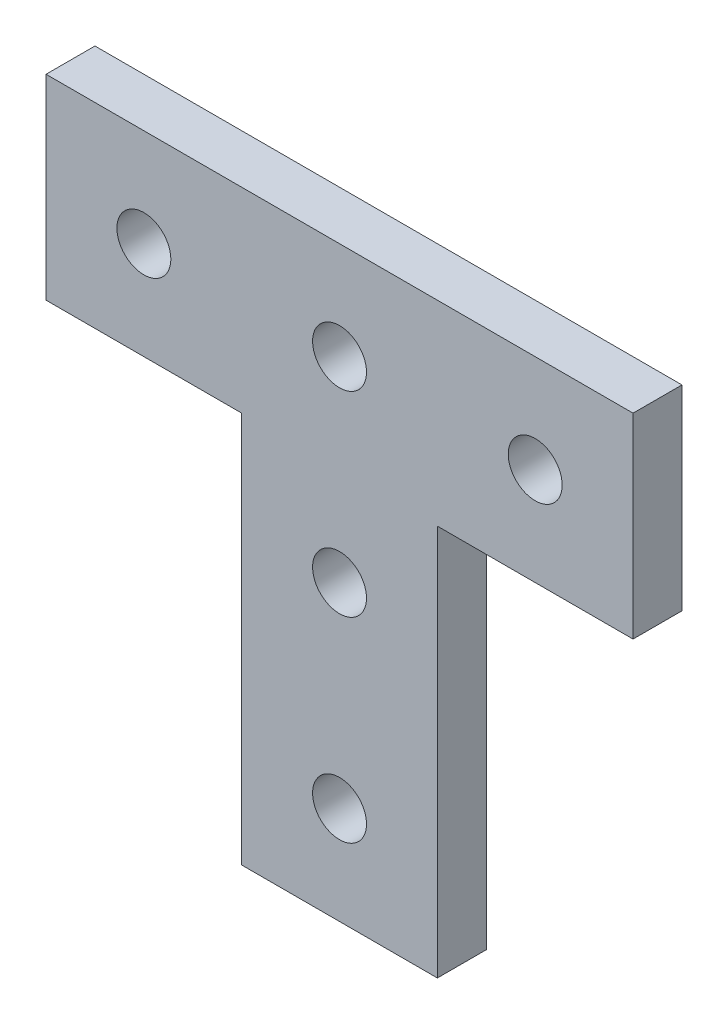
ISO-10303-21;
HEADER;
FILE_DESCRIPTION(('STEP AP214'),'2;1');
FILE_NAME('part.step','',(''),(''),'','','');
FILE_SCHEMA(('AUTOMOTIVE_DESIGN { 1 0 10303 214 1 1 1 1 }'));
ENDSEC;
DATA;
#1=APPLICATION_CONTEXT('core data for automotive mechanical design processes');
#2=APPLICATION_PROTOCOL_DEFINITION('international standard','automotive_design',2000,#1);
#3=PRODUCT_CONTEXT('',#1,'mechanical');
#4=PRODUCT('Part','Part','',(#3));
#5=PRODUCT_RELATED_PRODUCT_CATEGORY('part','',(#4));
#6=PRODUCT_DEFINITION_FORMATION('','',#4);
#7=PRODUCT_DEFINITION_CONTEXT('part definition',#1,'design');
#8=PRODUCT_DEFINITION('design','',#6,#7);
#9=PRODUCT_DEFINITION_SHAPE('','',#8);
#10=(LENGTH_UNIT() NAMED_UNIT(*) SI_UNIT(.MILLI.,.METRE.));
#11=(NAMED_UNIT(*) PLANE_ANGLE_UNIT() SI_UNIT($,.RADIAN.));
#12=(NAMED_UNIT(*) SI_UNIT($,.STERADIAN.) SOLID_ANGLE_UNIT());
#13=UNCERTAINTY_MEASURE_WITH_UNIT(LENGTH_MEASURE(1.E-05),#10,'distance_accuracy_value','');
#14=(GEOMETRIC_REPRESENTATION_CONTEXT(3) GLOBAL_UNCERTAINTY_ASSIGNED_CONTEXT((#13)) GLOBAL_UNIT_ASSIGNED_CONTEXT((#10,
#11,#12)) REPRESENTATION_CONTEXT('',''));
#15=CARTESIAN_POINT('',(0.,0.,0.));
#16=DIRECTION('',(0.,0.,1.));
#17=DIRECTION('',(1.,0.,0.));
#18=AXIS2_PLACEMENT_3D('',#15,#16,#17);
#19=CARTESIAN_POINT('',(12.7,50.8,6.35));
#20=DIRECTION('',(-1.,0.,0.));
#21=DIRECTION('',(0.,-1.,0.));
#22=AXIS2_PLACEMENT_3D('',#19,#20,#21);
#23=PLANE('',#22);
#24=DIRECTION('',(0.,1.,0.));
#25=VECTOR('',#24,1.);
#26=CARTESIAN_POINT('',(12.7,50.8,0.));
#27=LINE('',#26,#25);
#28=CARTESIAN_POINT('',(12.7,0.,0.));
#29=VERTEX_POINT('',#28);
#30=CARTESIAN_POINT('',(12.7,50.8,0.));
#31=VERTEX_POINT('',#30);
#32=EDGE_CURVE('E132',#29,#31,#27,.T.);
#33=ORIENTED_EDGE('',*,*,#32,.T.);
#34=DIRECTION('',(0.,0.,-1.));
#35=VECTOR('',#34,1.);
#36=CARTESIAN_POINT('',(12.7,50.8,6.35));
#37=LINE('',#36,#35);
#38=CARTESIAN_POINT('',(12.7,50.8,6.35));
#39=VERTEX_POINT('',#38);
#40=EDGE_CURVE('E11',#39,#31,#37,.T.);
#41=ORIENTED_EDGE('',*,*,#40,.F.);
#42=DIRECTION('',(0.,1.,0.));
#43=VECTOR('',#42,1.);
#44=CARTESIAN_POINT('',(12.7,50.8,6.35));
#45=LINE('',#44,#43);
#46=CARTESIAN_POINT('',(12.7,0.,6.35));
#47=VERTEX_POINT('',#46);
#48=EDGE_CURVE('E147',#47,#39,#45,.T.);
#49=ORIENTED_EDGE('',*,*,#48,.F.);
#50=DIRECTION('',(0.,0.,-1.));
#51=VECTOR('',#50,1.);
#52=CARTESIAN_POINT('',(12.7,0.,6.35));
#53=LINE('',#52,#51);
#54=EDGE_CURVE('E128',#47,#29,#53,.T.);
#55=ORIENTED_EDGE('',*,*,#54,.T.);
#56=EDGE_LOOP('',(#33,#41,#49,#55));
#57=FACE_BOUND('',#56,.T.);
#58=ADVANCED_FACE('F36',(#57),#23,.F.);
#59=CARTESIAN_POINT('',(38.1,50.8,6.35));
#60=DIRECTION('',(0.,1.,0.));
#61=DIRECTION('',(-1.,0.,0.));
#62=AXIS2_PLACEMENT_3D('',#59,#60,#61);
#63=PLANE('',#62);
#64=DIRECTION('',(1.,0.,0.));
#65=VECTOR('',#64,1.);
#66=CARTESIAN_POINT('',(38.1,50.8,0.));
#67=LINE('',#66,#65);
#68=CARTESIAN_POINT('',(38.1,50.8,0.));
#69=VERTEX_POINT('',#68);
#70=EDGE_CURVE('E135',#31,#69,#67,.T.);
#71=ORIENTED_EDGE('',*,*,#70,.T.);
#72=DIRECTION('',(0.,0.,-1.));
#73=VECTOR('',#72,1.);
#74=CARTESIAN_POINT('',(38.1,50.8,6.35));
#75=LINE('',#74,#73);
#76=CARTESIAN_POINT('',(38.1,50.8,6.35));
#77=VERTEX_POINT('',#76);
#78=EDGE_CURVE('E44',#77,#69,#75,.T.);
#79=ORIENTED_EDGE('',*,*,#78,.F.);
#80=DIRECTION('',(1.,0.,0.));
#81=VECTOR('',#80,1.);
#82=CARTESIAN_POINT('',(38.1,50.8,6.35));
#83=LINE('',#82,#81);
#84=EDGE_CURVE('E95',#39,#77,#83,.T.);
#85=ORIENTED_EDGE('',*,*,#84,.F.);
#86=ORIENTED_EDGE('',*,*,#40,.T.);
#87=EDGE_LOOP('',(#71,#79,#85,#86));
#88=FACE_BOUND('',#87,.T.);
#89=ADVANCED_FACE('F238',(#88),#63,.F.);
#90=CARTESIAN_POINT('',(38.1,76.2,6.35));
#91=DIRECTION('',(-1.,0.,0.));
#92=DIRECTION('',(0.,0.,1.));
#93=AXIS2_PLACEMENT_3D('',#90,#91,#92);
#94=PLANE('',#93);
#95=DIRECTION('',(0.,1.,0.));
#96=VECTOR('',#95,1.);
#97=CARTESIAN_POINT('',(38.1,76.2,0.));
#98=LINE('',#97,#96);
#99=CARTESIAN_POINT('',(38.1,76.2,0.));
#100=VERTEX_POINT('',#99);
#101=EDGE_CURVE('E138',#69,#100,#98,.T.);
#102=ORIENTED_EDGE('',*,*,#101,.T.);
#103=DIRECTION('',(0.,0.,-1.));
#104=VECTOR('',#103,1.);
#105=CARTESIAN_POINT('',(38.1,76.2,6.35));
#106=LINE('',#105,#104);
#107=CARTESIAN_POINT('',(38.1,76.2,6.35));
#108=VERTEX_POINT('',#107);
#109=EDGE_CURVE('E154',#108,#100,#106,.T.);
#110=ORIENTED_EDGE('',*,*,#109,.F.);
#111=DIRECTION('',(0.,1.,0.));
#112=VECTOR('',#111,1.);
#113=CARTESIAN_POINT('',(38.1,76.2,6.35));
#114=LINE('',#113,#112);
#115=EDGE_CURVE('E162',#77,#108,#114,.T.);
#116=ORIENTED_EDGE('',*,*,#115,.F.);
#117=ORIENTED_EDGE('',*,*,#78,.T.);
#118=EDGE_LOOP('',(#102,#110,#116,#117));
#119=FACE_BOUND('',#118,.T.);
#120=ADVANCED_FACE('F160',(#119),#94,.F.);
#121=CARTESIAN_POINT('',(-38.1,76.2,6.35));
#122=DIRECTION('',(0.,-1.,0.));
#123=DIRECTION('',(0.,0.,-1.));
#124=AXIS2_PLACEMENT_3D('',#121,#122,#123);
#125=PLANE('',#124);
#126=DIRECTION('',(-1.,0.,0.));
#127=VECTOR('',#126,1.);
#128=CARTESIAN_POINT('',(-38.1,76.2,0.));
#129=LINE('',#128,#127);
#130=CARTESIAN_POINT('',(-38.1,76.2,0.));
#131=VERTEX_POINT('',#130);
#132=EDGE_CURVE('E140',#100,#131,#129,.T.);
#133=ORIENTED_EDGE('',*,*,#132,.T.);
#134=DIRECTION('',(0.,0.,-1.));
#135=VECTOR('',#134,1.);
#136=CARTESIAN_POINT('',(-38.1,76.2,6.35));
#137=LINE('',#136,#135);
#138=CARTESIAN_POINT('',(-38.1,76.2,6.35));
#139=VERTEX_POINT('',#138);
#140=EDGE_CURVE('E151',#139,#131,#137,.T.);
#141=ORIENTED_EDGE('',*,*,#140,.F.);
#142=DIRECTION('',(-1.,0.,0.));
#143=VECTOR('',#142,1.);
#144=CARTESIAN_POINT('',(-38.1,76.2,6.35));
#145=LINE('',#144,#143);
#146=EDGE_CURVE('E174',#108,#139,#145,.T.);
#147=ORIENTED_EDGE('',*,*,#146,.F.);
#148=ORIENTED_EDGE('',*,*,#109,.T.);
#149=EDGE_LOOP('',(#133,#141,#147,#148));
#150=FACE_BOUND('',#149,.T.);
#151=ADVANCED_FACE('F170',(#150),#125,.F.);
#152=CARTESIAN_POINT('',(-38.1,50.8,6.35));
#153=DIRECTION('',(1.,0.,0.));
#154=DIRECTION('',(0.,0.,-1.));
#155=AXIS2_PLACEMENT_3D('',#152,#153,#154);
#156=PLANE('',#155);
#157=DIRECTION('',(0.,-1.,0.));
#158=VECTOR('',#157,1.);
#159=CARTESIAN_POINT('',(-38.1,50.8,0.));
#160=LINE('',#159,#158);
#161=CARTESIAN_POINT('',(-38.1,50.8,0.));
#162=VERTEX_POINT('',#161);
#163=EDGE_CURVE('E142',#131,#162,#160,.T.);
#164=ORIENTED_EDGE('',*,*,#163,.T.);
#165=DIRECTION('',(0.,0.,-1.));
#166=VECTOR('',#165,1.);
#167=CARTESIAN_POINT('',(-38.1,50.8,6.35));
#168=LINE('',#167,#166);
#169=CARTESIAN_POINT('',(-38.1,50.8,6.35));
#170=VERTEX_POINT('',#169);
#171=EDGE_CURVE('E123',#170,#162,#168,.T.);
#172=ORIENTED_EDGE('',*,*,#171,.F.);
#173=DIRECTION('',(0.,-1.,0.));
#174=VECTOR('',#173,1.);
#175=CARTESIAN_POINT('',(-38.1,50.8,6.35));
#176=LINE('',#175,#174);
#177=EDGE_CURVE('E114',#139,#170,#176,.T.);
#178=ORIENTED_EDGE('',*,*,#177,.F.);
#179=ORIENTED_EDGE('',*,*,#140,.T.);
#180=EDGE_LOOP('',(#164,#172,#178,#179));
#181=FACE_BOUND('',#180,.T.);
#182=ADVANCED_FACE('F173',(#181),#156,.F.);
#183=CARTESIAN_POINT('',(-12.7,50.8,6.35));
#184=DIRECTION('',(0.,1.,0.));
#185=DIRECTION('',(0.,0.,1.));
#186=AXIS2_PLACEMENT_3D('',#183,#184,#185);
#187=PLANE('',#186);
#188=DIRECTION('',(1.,0.,0.));
#189=VECTOR('',#188,1.);
#190=CARTESIAN_POINT('',(-12.7,50.8,0.));
#191=LINE('',#190,#189);
#192=CARTESIAN_POINT('',(-12.7,50.8,0.));
#193=VERTEX_POINT('',#192);
#194=EDGE_CURVE('E122',#162,#193,#191,.T.);
#195=ORIENTED_EDGE('',*,*,#194,.T.);
#196=DIRECTION('',(0.,0.,-1.));
#197=VECTOR('',#196,1.);
#198=CARTESIAN_POINT('',(-12.7,50.8,6.35));
#199=LINE('',#198,#197);
#200=CARTESIAN_POINT('',(-12.7,50.8,6.35));
#201=VERTEX_POINT('',#200);
#202=EDGE_CURVE('E119',#201,#193,#199,.T.);
#203=ORIENTED_EDGE('',*,*,#202,.F.);
#204=DIRECTION('',(1.,0.,0.));
#205=VECTOR('',#204,1.);
#206=CARTESIAN_POINT('',(-12.7,50.8,6.35));
#207=LINE('',#206,#205);
#208=EDGE_CURVE('E108',#170,#201,#207,.T.);
#209=ORIENTED_EDGE('',*,*,#208,.F.);
#210=ORIENTED_EDGE('',*,*,#171,.T.);
#211=EDGE_LOOP('',(#195,#203,#209,#210));
#212=FACE_BOUND('',#211,.T.);
#213=ADVANCED_FACE('F120',(#212),#187,.F.);
#214=CARTESIAN_POINT('',(-12.7,0.,6.35));
#215=DIRECTION('',(1.,0.,0.));
#216=DIRECTION('',(0.,0.,-1.));
#217=AXIS2_PLACEMENT_3D('',#214,#215,#216);
#218=PLANE('',#217);
#219=DIRECTION('',(0.,-1.,0.));
#220=VECTOR('',#219,1.);
#221=CARTESIAN_POINT('',(-12.7,0.,0.));
#222=LINE('',#221,#220);
#223=CARTESIAN_POINT('',(-12.7,0.,0.));
#224=VERTEX_POINT('',#223);
#225=EDGE_CURVE('E81',#193,#224,#222,.T.);
#226=ORIENTED_EDGE('',*,*,#225,.T.);
#227=DIRECTION('',(0.,0.,-1.));
#228=VECTOR('',#227,1.);
#229=CARTESIAN_POINT('',(-12.7,0.,6.35));
#230=LINE('',#229,#228);
#231=CARTESIAN_POINT('',(-12.7,0.,6.35));
#232=VERTEX_POINT('',#231);
#233=EDGE_CURVE('E124',#232,#224,#230,.T.);
#234=ORIENTED_EDGE('',*,*,#233,.F.);
#235=DIRECTION('',(0.,-1.,0.));
#236=VECTOR('',#235,1.);
#237=CARTESIAN_POINT('',(-12.7,0.,6.35));
#238=LINE('',#237,#236);
#239=EDGE_CURVE('E112',#201,#232,#238,.T.);
#240=ORIENTED_EDGE('',*,*,#239,.F.);
#241=ORIENTED_EDGE('',*,*,#202,.T.);
#242=EDGE_LOOP('',(#226,#234,#240,#241));
#243=FACE_BOUND('',#242,.T.);
#244=ADVANCED_FACE('F126',(#243),#218,.F.);
#245=CARTESIAN_POINT('',(12.7,0.,6.35));
#246=DIRECTION('',(0.,1.,0.));
#247=DIRECTION('',(-1.,0.,0.));
#248=AXIS2_PLACEMENT_3D('',#245,#246,#247);
#249=PLANE('',#248);
#250=DIRECTION('',(1.,0.,0.));
#251=VECTOR('',#250,1.);
#252=CARTESIAN_POINT('',(12.7,0.,0.));
#253=LINE('',#252,#251);
#254=EDGE_CURVE('E87',#224,#29,#253,.T.);
#255=ORIENTED_EDGE('',*,*,#254,.T.);
#256=ORIENTED_EDGE('',*,*,#54,.F.);
#257=DIRECTION('',(1.,0.,0.));
#258=VECTOR('',#257,1.);
#259=CARTESIAN_POINT('',(12.7,0.,6.35));
#260=LINE('',#259,#258);
#261=EDGE_CURVE('E52',#232,#47,#260,.T.);
#262=ORIENTED_EDGE('',*,*,#261,.F.);
#263=ORIENTED_EDGE('',*,*,#233,.T.);
#264=EDGE_LOOP('',(#255,#256,#262,#263));
#265=FACE_BOUND('',#264,.T.);
#266=ADVANCED_FACE('F222',(#265),#249,.F.);
#267=CARTESIAN_POINT('',(0.,0.,6.35));
#268=DIRECTION('',(0.,0.,-1.));
#269=DIRECTION('',(-1.,0.,0.));
#270=AXIS2_PLACEMENT_3D('',#267,#268,#269);
#271=PLANE('',#270);
#272=CARTESIAN_POINT('',(0.,12.7,6.35));
#273=DIRECTION('',(0.,0.,1.));
#274=DIRECTION('',(1.,0.,0.));
#275=AXIS2_PLACEMENT_3D('',#272,#273,#274);
#276=CIRCLE('',#275,3.5);
#277=CARTESIAN_POINT('',(3.5,12.7,6.35));
#278=VERTEX_POINT('',#277);
#279=EDGE_CURVE('E186',#278,#278,#276,.T.);
#280=ORIENTED_EDGE('',*,*,#279,.F.);
#281=EDGE_LOOP('',(#280));
#282=FACE_BOUND('',#281,.T.);
#283=CARTESIAN_POINT('',(0.,38.1,6.35));
#284=DIRECTION('',(0.,0.,1.));
#285=DIRECTION('',(1.,0.,0.));
#286=AXIS2_PLACEMENT_3D('',#283,#284,#285);
#287=CIRCLE('',#286,3.5);
#288=CARTESIAN_POINT('',(3.5,38.1,6.35));
#289=VERTEX_POINT('',#288);
#290=EDGE_CURVE('E192',#289,#289,#287,.T.);
#291=ORIENTED_EDGE('',*,*,#290,.F.);
#292=EDGE_LOOP('',(#291));
#293=FACE_BOUND('',#292,.T.);
#294=CARTESIAN_POINT('',(-25.4,63.5,6.35));
#295=DIRECTION('',(0.,0.,1.));
#296=DIRECTION('',(1.,0.,0.));
#297=AXIS2_PLACEMENT_3D('',#294,#295,#296);
#298=CIRCLE('',#297,3.5);
#299=CARTESIAN_POINT('',(-21.9,63.5,6.35));
#300=VERTEX_POINT('',#299);
#301=EDGE_CURVE('E198',#300,#300,#298,.T.);
#302=ORIENTED_EDGE('',*,*,#301,.F.);
#303=EDGE_LOOP('',(#302));
#304=FACE_BOUND('',#303,.T.);
#305=CARTESIAN_POINT('',(25.4,63.5,6.35));
#306=DIRECTION('',(0.,0.,1.));
#307=DIRECTION('',(1.,0.,0.));
#308=AXIS2_PLACEMENT_3D('',#305,#306,#307);
#309=CIRCLE('',#308,3.5);
#310=CARTESIAN_POINT('',(28.9,63.5,6.35));
#311=VERTEX_POINT('',#310);
#312=EDGE_CURVE('E204',#311,#311,#309,.T.);
#313=ORIENTED_EDGE('',*,*,#312,.F.);
#314=EDGE_LOOP('',(#313));
#315=FACE_BOUND('',#314,.T.);
#316=CARTESIAN_POINT('',(0.,63.5,6.35));
#317=DIRECTION('',(0.,0.,1.));
#318=DIRECTION('',(1.,0.,0.));
#319=AXIS2_PLACEMENT_3D('',#316,#317,#318);
#320=CIRCLE('',#319,3.5);
#321=CARTESIAN_POINT('',(3.5,63.5,6.35));
#322=VERTEX_POINT('',#321);
#323=EDGE_CURVE('E180',#322,#322,#320,.T.);
#324=ORIENTED_EDGE('',*,*,#323,.F.);
#325=EDGE_LOOP('',(#324));
#326=FACE_BOUND('',#325,.T.);
#327=ORIENTED_EDGE('',*,*,#48,.T.);
#328=ORIENTED_EDGE('',*,*,#84,.T.);
#329=ORIENTED_EDGE('',*,*,#115,.T.);
#330=ORIENTED_EDGE('',*,*,#146,.T.);
#331=ORIENTED_EDGE('',*,*,#177,.T.);
#332=ORIENTED_EDGE('',*,*,#208,.T.);
#333=ORIENTED_EDGE('',*,*,#239,.T.);
#334=ORIENTED_EDGE('',*,*,#261,.T.);
#335=EDGE_LOOP('',(#327,#328,#329,#330,#331,#332,#333,#334));
#336=FACE_BOUND('',#335,.T.);
#337=ADVANCED_FACE('F110',(#282,#293,#304,#315,#326,#336),#271,.F.);
#338=CARTESIAN_POINT('',(0.,0.,0.));
#339=DIRECTION('',(0.,0.,-1.));
#340=DIRECTION('',(-1.,0.,0.));
#341=AXIS2_PLACEMENT_3D('',#338,#339,#340);
#342=PLANE('',#341);
#343=CARTESIAN_POINT('',(0.,12.7,0.));
#344=DIRECTION('',(0.,0.,1.));
#345=DIRECTION('',(1.,0.,0.));
#346=AXIS2_PLACEMENT_3D('',#343,#344,#345);
#347=CIRCLE('',#346,3.5);
#348=CARTESIAN_POINT('',(3.5,12.7,0.));
#349=VERTEX_POINT('',#348);
#350=EDGE_CURVE('E189',#349,#349,#347,.T.);
#351=ORIENTED_EDGE('',*,*,#350,.T.);
#352=EDGE_LOOP('',(#351));
#353=FACE_BOUND('',#352,.T.);
#354=CARTESIAN_POINT('',(0.,38.1,0.));
#355=DIRECTION('',(0.,0.,1.));
#356=DIRECTION('',(1.,0.,0.));
#357=AXIS2_PLACEMENT_3D('',#354,#355,#356);
#358=CIRCLE('',#357,3.5);
#359=CARTESIAN_POINT('',(3.5,38.1,0.));
#360=VERTEX_POINT('',#359);
#361=EDGE_CURVE('E195',#360,#360,#358,.T.);
#362=ORIENTED_EDGE('',*,*,#361,.T.);
#363=EDGE_LOOP('',(#362));
#364=FACE_BOUND('',#363,.T.);
#365=CARTESIAN_POINT('',(-25.4,63.5,0.));
#366=DIRECTION('',(0.,0.,1.));
#367=DIRECTION('',(1.,0.,0.));
#368=AXIS2_PLACEMENT_3D('',#365,#366,#367);
#369=CIRCLE('',#368,3.5);
#370=CARTESIAN_POINT('',(-21.9,63.5,0.));
#371=VERTEX_POINT('',#370);
#372=EDGE_CURVE('E201',#371,#371,#369,.T.);
#373=ORIENTED_EDGE('',*,*,#372,.T.);
#374=EDGE_LOOP('',(#373));
#375=FACE_BOUND('',#374,.T.);
#376=CARTESIAN_POINT('',(25.4,63.5,0.));
#377=DIRECTION('',(0.,0.,1.));
#378=DIRECTION('',(1.,0.,0.));
#379=AXIS2_PLACEMENT_3D('',#376,#377,#378);
#380=CIRCLE('',#379,3.5);
#381=CARTESIAN_POINT('',(28.9,63.5,0.));
#382=VERTEX_POINT('',#381);
#383=EDGE_CURVE('E183',#382,#382,#380,.T.);
#384=ORIENTED_EDGE('',*,*,#383,.T.);
#385=EDGE_LOOP('',(#384));
#386=FACE_BOUND('',#385,.T.);
#387=CARTESIAN_POINT('',(0.,63.5,0.));
#388=DIRECTION('',(0.,0.,1.));
#389=DIRECTION('',(1.,0.,0.));
#390=AXIS2_PLACEMENT_3D('',#387,#388,#389);
#391=CIRCLE('',#390,3.5);
#392=CARTESIAN_POINT('',(3.5,63.5,0.));
#393=VERTEX_POINT('',#392);
#394=EDGE_CURVE('E136',#393,#393,#391,.T.);
#395=ORIENTED_EDGE('',*,*,#394,.T.);
#396=EDGE_LOOP('',(#395));
#397=FACE_BOUND('',#396,.T.);
#398=ORIENTED_EDGE('',*,*,#32,.F.);
#399=ORIENTED_EDGE('',*,*,#254,.F.);
#400=ORIENTED_EDGE('',*,*,#225,.F.);
#401=ORIENTED_EDGE('',*,*,#194,.F.);
#402=ORIENTED_EDGE('',*,*,#163,.F.);
#403=ORIENTED_EDGE('',*,*,#132,.F.);
#404=ORIENTED_EDGE('',*,*,#101,.F.);
#405=ORIENTED_EDGE('',*,*,#70,.F.);
#406=EDGE_LOOP('',(#398,#399,#400,#401,#402,#403,#404,#405));
#407=FACE_BOUND('',#406,.T.);
#408=ADVANCED_FACE('F166',(#353,#364,#375,#386,#397,#407),#342,.T.);
#409=CARTESIAN_POINT('',(0.,63.5,0.));
#410=DIRECTION('',(0.,0.,1.));
#411=DIRECTION('',(1.,0.,0.));
#412=AXIS2_PLACEMENT_3D('',#409,#410,#411);
#413=CYLINDRICAL_SURFACE('',#412,3.5);
#414=ORIENTED_EDGE('',*,*,#394,.F.);
#415=EDGE_LOOP('',(#414));
#416=FACE_BOUND('',#415,.T.);
#417=ORIENTED_EDGE('',*,*,#323,.T.);
#418=EDGE_LOOP('',(#417));
#419=FACE_BOUND('',#418,.T.);
#420=ADVANCED_FACE('F216',(#416,#419),#413,.F.);
#421=CARTESIAN_POINT('',(25.4,63.5,0.));
#422=DIRECTION('',(0.,0.,1.));
#423=DIRECTION('',(1.,0.,0.));
#424=AXIS2_PLACEMENT_3D('',#421,#422,#423);
#425=CYLINDRICAL_SURFACE('',#424,3.5);
#426=ORIENTED_EDGE('',*,*,#383,.F.);
#427=EDGE_LOOP('',(#426));
#428=FACE_BOUND('',#427,.T.);
#429=ORIENTED_EDGE('',*,*,#312,.T.);
#430=EDGE_LOOP('',(#429));
#431=FACE_BOUND('',#430,.T.);
#432=ADVANCED_FACE('F212',(#428,#431),#425,.F.);
#433=CARTESIAN_POINT('',(-25.4,63.5,0.));
#434=DIRECTION('',(0.,0.,1.));
#435=DIRECTION('',(1.,0.,0.));
#436=AXIS2_PLACEMENT_3D('',#433,#434,#435);
#437=CYLINDRICAL_SURFACE('',#436,3.5);
#438=ORIENTED_EDGE('',*,*,#372,.F.);
#439=EDGE_LOOP('',(#438));
#440=FACE_BOUND('',#439,.T.);
#441=ORIENTED_EDGE('',*,*,#301,.T.);
#442=EDGE_LOOP('',(#441));
#443=FACE_BOUND('',#442,.T.);
#444=ADVANCED_FACE('F215',(#440,#443),#437,.F.);
#445=CARTESIAN_POINT('',(0.,38.1,0.));
#446=DIRECTION('',(0.,0.,1.));
#447=DIRECTION('',(1.,0.,0.));
#448=AXIS2_PLACEMENT_3D('',#445,#446,#447);
#449=CYLINDRICAL_SURFACE('',#448,3.5);
#450=ORIENTED_EDGE('',*,*,#361,.F.);
#451=EDGE_LOOP('',(#450));
#452=FACE_BOUND('',#451,.T.);
#453=ORIENTED_EDGE('',*,*,#290,.T.);
#454=EDGE_LOOP('',(#453));
#455=FACE_BOUND('',#454,.T.);
#456=ADVANCED_FACE('F314',(#452,#455),#449,.F.);
#457=CARTESIAN_POINT('',(0.,12.7,0.));
#458=DIRECTION('',(0.,0.,1.));
#459=DIRECTION('',(1.,0.,0.));
#460=AXIS2_PLACEMENT_3D('',#457,#458,#459);
#461=CYLINDRICAL_SURFACE('',#460,3.5);
#462=ORIENTED_EDGE('',*,*,#350,.F.);
#463=EDGE_LOOP('',(#462));
#464=FACE_BOUND('',#463,.T.);
#465=ORIENTED_EDGE('',*,*,#279,.T.);
#466=EDGE_LOOP('',(#465));
#467=FACE_BOUND('',#466,.T.);
#468=ADVANCED_FACE('F324',(#464,#467),#461,.F.);
#469=CLOSED_SHELL('',(#58,#89,#120,#151,#182,#213,#244,#266,#337,#408,#420,#432,#444,#456,#468));
#470=MANIFOLD_SOLID_BREP('B2',#469);
#471=ADVANCED_BREP_SHAPE_REPRESENTATION('',(#18,#470),#14);
#472=SHAPE_DEFINITION_REPRESENTATION(#9,#471);
ENDSEC;
END-ISO-10303-21;
